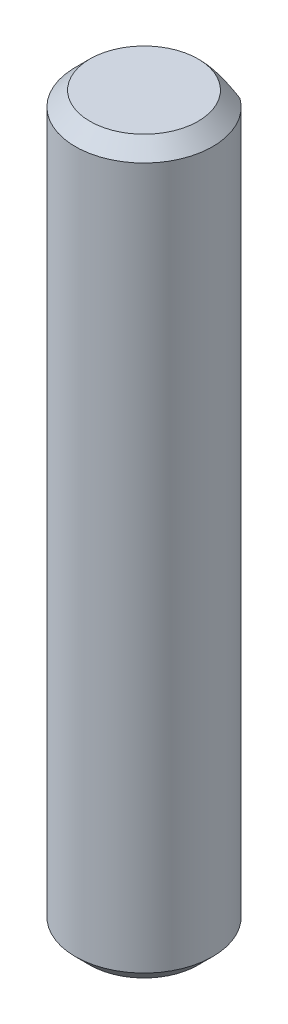
ISO-10303-21;
HEADER;
FILE_DESCRIPTION(('STEP AP214'),'2;1');
FILE_NAME('part.step','',(''),(''),'','','');
FILE_SCHEMA(('AUTOMOTIVE_DESIGN { 1 0 10303 214 1 1 1 1 }'));
ENDSEC;
DATA;
#1=APPLICATION_CONTEXT('core data for automotive mechanical design processes');
#2=APPLICATION_PROTOCOL_DEFINITION('international standard','automotive_design',2000,#1);
#3=PRODUCT_CONTEXT('',#1,'mechanical');
#4=PRODUCT('Part','Part','',(#3));
#5=PRODUCT_RELATED_PRODUCT_CATEGORY('part','',(#4));
#6=PRODUCT_DEFINITION_FORMATION('','',#4);
#7=PRODUCT_DEFINITION_CONTEXT('part definition',#1,'design');
#8=PRODUCT_DEFINITION('design','',#6,#7);
#9=PRODUCT_DEFINITION_SHAPE('','',#8);
#10=(LENGTH_UNIT() NAMED_UNIT(*) SI_UNIT(.MILLI.,.METRE.));
#11=(NAMED_UNIT(*) PLANE_ANGLE_UNIT() SI_UNIT($,.RADIAN.));
#12=(NAMED_UNIT(*) SI_UNIT($,.STERADIAN.) SOLID_ANGLE_UNIT());
#13=UNCERTAINTY_MEASURE_WITH_UNIT(LENGTH_MEASURE(1.E-05),#10,'distance_accuracy_value','');
#14=(GEOMETRIC_REPRESENTATION_CONTEXT(3) GLOBAL_UNCERTAINTY_ASSIGNED_CONTEXT((#13)) GLOBAL_UNIT_ASSIGNED_CONTEXT((#10,
#11,#12)) REPRESENTATION_CONTEXT('',''));
#15=CARTESIAN_POINT('',(0.,0.,0.));
#16=DIRECTION('',(0.,0.,1.));
#17=DIRECTION('',(1.,0.,0.));
#18=AXIS2_PLACEMENT_3D('',#15,#16,#17);
#19=CARTESIAN_POINT('',(0.,-12.5,0.));
#20=DIRECTION('',(0.,-1.,0.));
#21=DIRECTION('',(0.,0.,-1.));
#22=AXIS2_PLACEMENT_3D('',#19,#20,#21);
#23=PLANE('',#22);
#24=CARTESIAN_POINT('',(0.,-12.5,0.));
#25=DIRECTION('',(0.,1.,0.));
#26=DIRECTION('',(0.,0.,1.));
#27=AXIS2_PLACEMENT_3D('',#24,#25,#26);
#28=CIRCLE('',#27,1.84999999999999);
#29=CARTESIAN_POINT('',(0.,-12.5,1.84999999999999));
#30=VERTEX_POINT('',#29);
#31=EDGE_CURVE('E48',#30,#30,#28,.T.);
#32=ORIENTED_EDGE('',*,*,#31,.F.);
#33=EDGE_LOOP('',(#32));
#34=FACE_BOUND('',#33,.T.);
#35=ADVANCED_FACE('F36',(#34),#23,.T.);
#36=CARTESIAN_POINT('',(0.,-12.,0.));
#37=DIRECTION('',(0.,1.,0.));
#38=DIRECTION('',(0.,0.,1.));
#39=AXIS2_PLACEMENT_3D('',#36,#37,#38);
#40=CONICAL_SURFACE('',#39,2.34999999999999,0.785398163397456);
#41=CARTESIAN_POINT('',(-2.78781240602745,-10.9762931349626,-1.90000000000001));
#42=CARTESIAN_POINT('',(-2.72185595781875,-11.0307840497963,-1.90000000000001));
#43=CARTESIAN_POINT('',(-2.65560661463991,-11.0849251501931,-1.90000000000001));
#44=CARTESIAN_POINT('',(-2.52238470225299,-11.1923344637348,-1.90000000000001));
#45=CARTESIAN_POINT('',(-2.455412003031,-11.2456025154788,-1.90000000000001));
#46=CARTESIAN_POINT('',(-2.32013833162188,-11.3514571308574,-1.90000000000001));
#47=CARTESIAN_POINT('',(-2.25183123366936,-11.4040358878457,-1.90000000000001));
#48=CARTESIAN_POINT('',(-2.11420688073249,-11.5078479405502,-1.90000000000001));
#49=CARTESIAN_POINT('',(-2.04488969238677,-11.5590813244053,-1.90000000000001));
#50=CARTESIAN_POINT('',(-1.89846175564355,-11.6646061189509,-1.90000000000001));
#51=CARTESIAN_POINT('',(-1.82123114168533,-11.7187319818354,-1.90000000000001));
#52=CARTESIAN_POINT('',(-1.66499420611709,-11.8243535167927,-1.90000000000001));
#53=CARTESIAN_POINT('',(-1.58598809667105,-11.8758495007433,-1.90000000000001));
#54=CARTESIAN_POINT('',(-1.42601615720946,-11.975215604845,-1.90000000000001));
#55=CARTESIAN_POINT('',(-1.34505639943127,-12.0230954258753,-1.90000000000001));
#56=CARTESIAN_POINT('',(-1.18055417745644,-12.1141522485779,-1.90000000000001));
#57=CARTESIAN_POINT('',(-1.09701315073753,-12.1573318092603,-1.90000000000001));
#58=CARTESIAN_POINT('',(-0.940722350989704,-12.2307991616582,-1.90000000000001));
#59=CARTESIAN_POINT('',(-0.868425933293047,-12.2620415906224,-1.90000000000001));
#60=CARTESIAN_POINT('',(-0.721549948424502,-12.3187323538195,-1.90000000000001));
#61=CARTESIAN_POINT('',(-0.646970221996205,-12.3441802828481,-1.90000000000001));
#62=CARTESIAN_POINT('',(-0.497378251438239,-12.3872519235408,-1.90000000000001));
#63=CARTESIAN_POINT('',(-0.422414421990581,-12.405040422098,-1.90000000000001));
#64=CARTESIAN_POINT('',(-0.270971352430011,-12.4322165348056,-1.90000000000001));
#65=CARTESIAN_POINT('',(-0.194492839607588,-12.4416080854481,-1.90000000000001));
#66=CARTESIAN_POINT('',(-0.0476649092528885,-12.4506897103319,-1.90000000000001));
#67=CARTESIAN_POINT('',(0.0226362612778616,-12.4511556518792,-1.90000000000001));
#68=CARTESIAN_POINT('',(0.162854509517232,-12.4443198277811,-1.90000000000001));
#69=CARTESIAN_POINT('',(0.232771574610283,-12.4370178085196,-1.90000000000001));
#70=CARTESIAN_POINT('',(0.372080248620861,-12.4151457601236,-1.90000000000001));
#71=CARTESIAN_POINT('',(0.441461446037983,-12.4005108339387,-1.90000000000001));
#72=CARTESIAN_POINT('',(0.578580693046688,-12.3649642948087,-1.90000000000001));
#73=CARTESIAN_POINT('',(0.646318278246142,-12.3440509297456,-1.90000000000001));
#74=CARTESIAN_POINT('',(0.837490639207416,-12.2768859098435,-1.90000000000001));
#75=CARTESIAN_POINT('',(0.9586914243564,-12.2243169481242,-1.90000000000001));
#76=CARTESIAN_POINT('',(1.19538215048833,-12.1076133571126,-1.90000000000001));
#77=CARTESIAN_POINT('',(1.31086167113065,-12.0434585465365,-1.90000000000001));
#78=CARTESIAN_POINT('',(1.53873463311559,-11.9067837506579,-1.90000000000001));
#79=CARTESIAN_POINT('',(1.65106899929089,-11.834166477739,-1.90000000000001));
#80=CARTESIAN_POINT('',(1.81686318941707,-11.721431778212,-1.90000000000001));
#81=CARTESIAN_POINT('',(1.87165491603085,-11.6832350866117,-1.90000000000001));
#82=CARTESIAN_POINT('',(1.98047361676586,-11.6057673867942,-1.90000000000001));
#83=CARTESIAN_POINT('',(2.03450060781184,-11.5664964024094,-1.90000000000001));
#84=CARTESIAN_POINT('',(2.17972320966554,-11.4590850025912,-1.90000000000001));
#85=CARTESIAN_POINT('',(2.27029052233496,-11.3900963112351,-1.90000000000001));
#86=CARTESIAN_POINT('',(2.44991338772457,-11.2501739130728,-1.90000000000001));
#87=CARTESIAN_POINT('',(2.53896881840342,-11.1792400504469,-1.90000000000001));
#88=CARTESIAN_POINT('',(2.80438411206754,-10.9641874752313,-1.90000000000001));
#89=CARTESIAN_POINT('',(2.97894620566873,-10.8178531522442,-1.90000000000001));
#90=CARTESIAN_POINT('',(3.32518984360542,-10.5212955663163,-1.90000000000001));
#91=CARTESIAN_POINT('',(3.49686631964078,-10.3710664432168,-1.90000000000001));
#92=CARTESIAN_POINT('',(3.83799964497178,-10.0681673262064,-1.90000000000001));
#93=CARTESIAN_POINT('',(4.00745684106282,-9.91549772214023,-1.90000000000001));
#94=CARTESIAN_POINT('',(4.32969287093256,-9.62218694103672,-1.90000000000001));
#95=CARTESIAN_POINT('',(4.48260619208473,-9.48169307306375,-1.90000000000001));
#96=CARTESIAN_POINT('',(4.78744894960945,-9.19962825511673,-1.90000000000001));
#97=CARTESIAN_POINT('',(4.93937833860385,-9.05805725398016,-1.90000000000001));
#98=CARTESIAN_POINT('',(5.2419982402832,-8.77454061571703,-1.90000000000001));
#99=CARTESIAN_POINT('',(5.39269113841204,-8.63259752164043,-1.90000000000001));
#100=CARTESIAN_POINT('',(5.6934555442215,-8.34807450026307,-1.90000000000001));
#101=CARTESIAN_POINT('',(5.8435270930148,-8.20549461643752,-1.90000000000001));
#102=CARTESIAN_POINT('',(5.99336826938945,-8.06267439903708,-1.90000000000001));
#103=B_SPLINE_CURVE_WITH_KNOTS('',3,(#41,#42,#43,#44,#45,#46,#47,#48,#49,#50,#51,#52,#53,#54,
#55,#56,#57,#58,#59,#60,#61,#62,#63,#64,#65,#66,#67,#68,#69,#70,#71,#72,#73,#74,#75,#76,#77,#78,
#79,#80,#81,#82,#83,#84,#85,#86,#87,#88,#89,#90,#91,#92,#93,#94,#95,#96,#97,#98,#99,#100,#101,
#102),.UNSPECIFIED.,.F.,.F.,(4,2,2,2,2,2,2,2,2,2,2,2,2,2,2,2,2,2,2,2,2,2,2,2,2,2,2,2,2,2,4),(0.,
0.256665695702936,0.513378317965733,0.771963733320756,1.03053216558589,1.31341798921737,
1.59627018710187,1.87833444992119,2.16024436937547,2.39632792603553,2.632427986754,
2.86315829958042,3.09378038915646,3.30425474708065,3.51473597699055,3.72711379202154,
3.93955093031551,4.33480569661595,4.73075571351885,5.13181660536085,5.33218381838248,
5.5325465900205,5.87405928177057,6.21559941108839,6.89885549556163,7.58320728110218,
8.26745081892843,8.89041292158902,9.51340480125503,10.1344548896879,10.7554632066151),.UNSPECIFIED.);
#104=CARTESIAN_POINT('',(1.3829316685939,-12.,-1.90000000000001));
#105=VERTEX_POINT('',#104);
#106=CARTESIAN_POINT('',(-1.3829316685939,-12.,-1.90000000000001));
#107=VERTEX_POINT('',#106);
#108=EDGE_CURVE('E59',#105,#107,#103,.F.);
#109=ORIENTED_EDGE('',*,*,#108,.F.);
#110=CARTESIAN_POINT('',(0.,-12.,0.));
#111=DIRECTION('',(0.,1.,0.));
#112=DIRECTION('',(0.,0.,1.));
#113=AXIS2_PLACEMENT_3D('',#110,#111,#112);
#114=CIRCLE('',#113,2.34999999999999);
#115=EDGE_CURVE('E75',#107,#105,#114,.T.);
#116=ORIENTED_EDGE('',*,*,#115,.F.);
#117=EDGE_LOOP('',(#109,#116));
#118=FACE_BOUND('',#117,.T.);
#119=ORIENTED_EDGE('',*,*,#31,.T.);
#120=EDGE_LOOP('',(#119));
#121=FACE_BOUND('',#120,.T.);
#122=ADVANCED_FACE('F73',(#118,#121),#40,.T.);
#123=CARTESIAN_POINT('',(0.,12.5,0.));
#124=DIRECTION('',(0.,1.,0.));
#125=DIRECTION('',(0.,0.,1.));
#126=AXIS2_PLACEMENT_3D('',#123,#124,#125);
#127=CYLINDRICAL_SURFACE('',#126,2.34999999999999);
#128=DIRECTION('',(0.,1.,0.));
#129=VECTOR('',#128,1.);
#130=CARTESIAN_POINT('',(1.3829316685939,-12.5,-1.90000000000001));
#131=LINE('',#130,#129);
#132=CARTESIAN_POINT('',(1.3829316685939,12.,-1.90000000000001));
#133=VERTEX_POINT('',#132);
#134=EDGE_CURVE('E64',#105,#133,#131,.T.);
#135=ORIENTED_EDGE('',*,*,#134,.T.);
#136=CARTESIAN_POINT('',(0.,12.,0.));
#137=DIRECTION('',(0.,1.,0.));
#138=DIRECTION('',(0.,0.,1.));
#139=AXIS2_PLACEMENT_3D('',#136,#137,#138);
#140=CIRCLE('',#139,2.34999999999999);
#141=CARTESIAN_POINT('',(-1.3829316685939,12.,-1.90000000000001));
#142=VERTEX_POINT('',#141);
#143=EDGE_CURVE('E79',#142,#133,#140,.T.);
#144=ORIENTED_EDGE('',*,*,#143,.F.);
#145=DIRECTION('',(0.,1.,0.));
#146=VECTOR('',#145,1.);
#147=CARTESIAN_POINT('',(-1.3829316685939,-12.5,-1.90000000000001));
#148=LINE('',#147,#146);
#149=EDGE_CURVE('E54',#107,#142,#148,.T.);
#150=ORIENTED_EDGE('',*,*,#149,.F.);
#151=ORIENTED_EDGE('',*,*,#115,.T.);
#152=EDGE_LOOP('',(#135,#144,#150,#151));
#153=FACE_BOUND('',#152,.T.);
#154=ADVANCED_FACE('F78',(#153),#127,.T.);
#155=CARTESIAN_POINT('',(0.,12.5,0.));
#156=DIRECTION('',(0.,-1.,0.));
#157=DIRECTION('',(0.,0.,-1.));
#158=AXIS2_PLACEMENT_3D('',#155,#156,#157);
#159=CONICAL_SURFACE('',#158,1.84999999999999,0.785398163397448);
#160=CARTESIAN_POINT('',(-2.78781240602743,10.9762931349626,-1.90000000000001));
#161=CARTESIAN_POINT('',(-2.72185595781873,11.0307840497963,-1.90000000000001));
#162=CARTESIAN_POINT('',(-2.65560661463989,11.0849251501931,-1.90000000000001));
#163=CARTESIAN_POINT('',(-2.52238470225298,11.1923344637348,-1.90000000000001));
#164=CARTESIAN_POINT('',(-2.45541200303099,11.2456025154788,-1.90000000000001));
#165=CARTESIAN_POINT('',(-2.32013833162186,11.3514571308574,-1.90000000000001));
#166=CARTESIAN_POINT('',(-2.25183123366934,11.4040358878457,-1.90000000000001));
#167=CARTESIAN_POINT('',(-2.11420688073248,11.5078479405502,-1.90000000000001));
#168=CARTESIAN_POINT('',(-2.04488969238676,11.5590813244053,-1.90000000000001));
#169=CARTESIAN_POINT('',(-1.89846175564354,11.6646061189509,-1.90000000000001));
#170=CARTESIAN_POINT('',(-1.82123114168532,11.7187319818354,-1.90000000000001));
#171=CARTESIAN_POINT('',(-1.66499420611708,11.8243535167927,-1.90000000000001));
#172=CARTESIAN_POINT('',(-1.58598809667104,11.8758495007433,-1.90000000000001));
#173=CARTESIAN_POINT('',(-1.42601615720946,11.975215604845,-1.90000000000001));
#174=CARTESIAN_POINT('',(-1.34505639943127,12.0230954258753,-1.90000000000001));
#175=CARTESIAN_POINT('',(-1.18055417745644,12.1141522485779,-1.90000000000001));
#176=CARTESIAN_POINT('',(-1.09701315073753,12.1573318092603,-1.90000000000001));
#177=CARTESIAN_POINT('',(-0.940722350989705,12.2307991616582,-1.90000000000001));
#178=CARTESIAN_POINT('',(-0.868425933293049,12.2620415906224,-1.90000000000001));
#179=CARTESIAN_POINT('',(-0.721549948424506,12.3187323538195,-1.90000000000001));
#180=CARTESIAN_POINT('',(-0.646970221996209,12.3441802828481,-1.90000000000001));
#181=CARTESIAN_POINT('',(-0.497378251438245,12.3872519235408,-1.90000000000001));
#182=CARTESIAN_POINT('',(-0.422414421990588,12.405040422098,-1.90000000000001));
#183=CARTESIAN_POINT('',(-0.270971352430019,12.4322165348056,-1.90000000000001));
#184=CARTESIAN_POINT('',(-0.194492839607598,12.4416080854481,-1.90000000000001));
#185=CARTESIAN_POINT('',(-0.0476649092528996,12.4506897103319,-1.90000000000001));
#186=CARTESIAN_POINT('',(0.02263626127785,12.4511556518792,-1.90000000000001));
#187=CARTESIAN_POINT('',(0.162854509517219,12.4443198277811,-1.90000000000001));
#188=CARTESIAN_POINT('',(0.23277157461027,12.4370178085196,-1.90000000000001));
#189=CARTESIAN_POINT('',(0.372080248620846,12.4151457601236,-1.90000000000001));
#190=CARTESIAN_POINT('',(0.441461446037968,12.4005108339387,-1.90000000000001));
#191=CARTESIAN_POINT('',(0.578580693046672,12.3649642948088,-1.90000000000001));
#192=CARTESIAN_POINT('',(0.646318278246126,12.3440509297456,-1.90000000000001));
#193=CARTESIAN_POINT('',(0.837490639207394,12.2768859098435,-1.90000000000001));
#194=CARTESIAN_POINT('',(0.958691424356373,12.2243169481243,-1.90000000000001));
#195=CARTESIAN_POINT('',(1.19538215048829,12.1076133571127,-1.90000000000001));
#196=CARTESIAN_POINT('',(1.31086167113061,12.0434585465366,-1.90000000000001));
#197=CARTESIAN_POINT('',(1.53873463311554,11.906783750658,-1.90000000000001));
#198=CARTESIAN_POINT('',(1.65106899929083,11.8341664777391,-1.90000000000001));
#199=CARTESIAN_POINT('',(1.81686318941701,11.7214317782121,-1.90000000000001));
#200=CARTESIAN_POINT('',(1.87165491603079,11.6832350866118,-1.90000000000001));
#201=CARTESIAN_POINT('',(1.98047361676579,11.6057673867943,-1.90000000000001));
#202=CARTESIAN_POINT('',(2.03450060781177,11.5664964024094,-1.90000000000001));
#203=CARTESIAN_POINT('',(2.17972320966546,11.4590850025913,-1.90000000000001));
#204=CARTESIAN_POINT('',(2.27029052233489,11.3900963112352,-1.90000000000001));
#205=CARTESIAN_POINT('',(2.4499133877245,11.2501739130728,-1.90000000000001));
#206=CARTESIAN_POINT('',(2.53896881840335,11.1792400504469,-1.90000000000001));
#207=CARTESIAN_POINT('',(2.80438411206747,10.9641874752314,-1.90000000000001));
#208=CARTESIAN_POINT('',(2.97894620566866,10.8178531522442,-1.90000000000001));
#209=CARTESIAN_POINT('',(3.32518984360536,10.5212955663163,-1.90000000000001));
#210=CARTESIAN_POINT('',(3.49686631964071,10.3710664432169,-1.90000000000001));
#211=CARTESIAN_POINT('',(3.83799964497171,10.0681673262064,-1.90000000000001));
#212=CARTESIAN_POINT('',(4.00745684106275,9.91549772214026,-1.90000000000001));
#213=CARTESIAN_POINT('',(4.32969287093249,9.62218694103674,-1.90000000000001));
#214=CARTESIAN_POINT('',(4.48260619208466,9.48169307306378,-1.90000000000001));
#215=CARTESIAN_POINT('',(4.78744894960937,9.19962825511676,-1.90000000000001));
#216=CARTESIAN_POINT('',(4.93937833860377,9.05805725398019,-1.90000000000001));
#217=CARTESIAN_POINT('',(5.24199824028312,8.77454061571706,-1.90000000000001));
#218=CARTESIAN_POINT('',(5.39269113841196,8.63259752164045,-1.90000000000001));
#219=CARTESIAN_POINT('',(5.69345554422142,8.34807450026309,-1.90000000000001));
#220=CARTESIAN_POINT('',(5.84352709301472,8.20549461643754,-1.90000000000001));
#221=CARTESIAN_POINT('',(5.99336826938936,8.0626743990371,-1.90000000000001));
#222=B_SPLINE_CURVE_WITH_KNOTS('',3,(#160,#161,#162,#163,#164,#165,#166,#167,#168,#169,#170,
#171,#172,#173,#174,#175,#176,#177,#178,#179,#180,#181,#182,#183,#184,#185,#186,#187,#188,#189,
#190,#191,#192,#193,#194,#195,#196,#197,#198,#199,#200,#201,#202,#203,#204,#205,#206,#207,#208,
#209,#210,#211,#212,#213,#214,#215,#216,#217,#218,#219,#220,#221),.UNSPECIFIED.,.F.,.F.,(4,2,2,
2,2,2,2,2,2,2,2,2,2,2,2,2,2,2,2,2,2,2,2,2,2,2,2,2,2,2,4),(0.,0.256665695702935,0.51337831796573,
0.77196373332075,1.03053216558588,1.31341798921736,1.59627018710186,1.87833444992118,
2.16024436937546,2.39632792603552,2.63242798675398,2.8631582995804,3.09378038915644,
3.30425474708062,3.51473597699053,3.72711379202151,3.93955093031548,4.3348056966159,
4.73075571351878,5.13181660536077,5.33218381838239,5.5325465900204,5.87405928177047,
6.2155994110883,6.89885549556154,7.58320728110209,8.26745081892834,8.89041292158893,
9.51340480125494,10.1344548896878,10.755463206615),.UNSPECIFIED.);
#223=EDGE_CURVE('E11',#142,#133,#222,.T.);
#224=ORIENTED_EDGE('',*,*,#223,.F.);
#225=ORIENTED_EDGE('',*,*,#143,.T.);
#226=EDGE_LOOP('',(#224,#225));
#227=FACE_BOUND('',#226,.T.);
#228=CARTESIAN_POINT('',(0.,12.5,0.));
#229=DIRECTION('',(0.,1.,0.));
#230=DIRECTION('',(0.,0.,1.));
#231=AXIS2_PLACEMENT_3D('',#228,#229,#230);
#232=CIRCLE('',#231,1.84999999999999);
#233=CARTESIAN_POINT('',(0.,12.5,1.84999999999999));
#234=VERTEX_POINT('',#233);
#235=EDGE_CURVE('E76',#234,#234,#232,.T.);
#236=ORIENTED_EDGE('',*,*,#235,.F.);
#237=EDGE_LOOP('',(#236));
#238=FACE_BOUND('',#237,.T.);
#239=ADVANCED_FACE('F95',(#227,#238),#159,.T.);
#240=CARTESIAN_POINT('',(-1.84999999999999,12.5,0.));
#241=DIRECTION('',(0.,1.,0.));
#242=DIRECTION('',(0.,0.,1.));
#243=AXIS2_PLACEMENT_3D('',#240,#241,#242);
#244=PLANE('',#243);
#245=ORIENTED_EDGE('',*,*,#235,.T.);
#246=EDGE_LOOP('',(#245));
#247=FACE_BOUND('',#246,.T.);
#248=ADVANCED_FACE('F98',(#247),#244,.T.);
#249=CARTESIAN_POINT('',(0.,-12.5,-1.90000000000001));
#250=DIRECTION('',(0.,0.,1.));
#251=DIRECTION('',(1.,0.,0.));
#252=AXIS2_PLACEMENT_3D('',#249,#250,#251);
#253=PLANE('',#252);
#254=ORIENTED_EDGE('',*,*,#108,.T.);
#255=ORIENTED_EDGE('',*,*,#149,.T.);
#256=ORIENTED_EDGE('',*,*,#223,.T.);
#257=ORIENTED_EDGE('',*,*,#134,.F.);
#258=EDGE_LOOP('',(#254,#255,#256,#257));
#259=FACE_BOUND('',#258,.T.);
#260=ADVANCED_FACE('F65',(#259),#253,.F.);
#261=CLOSED_SHELL('',(#35,#122,#154,#239,#248,#260));
#262=MANIFOLD_SOLID_BREP('B2',#261);
#263=ADVANCED_BREP_SHAPE_REPRESENTATION('',(#18,#262),#14);
#264=SHAPE_DEFINITION_REPRESENTATION(#9,#263);
ENDSEC;
END-ISO-10303-21;
